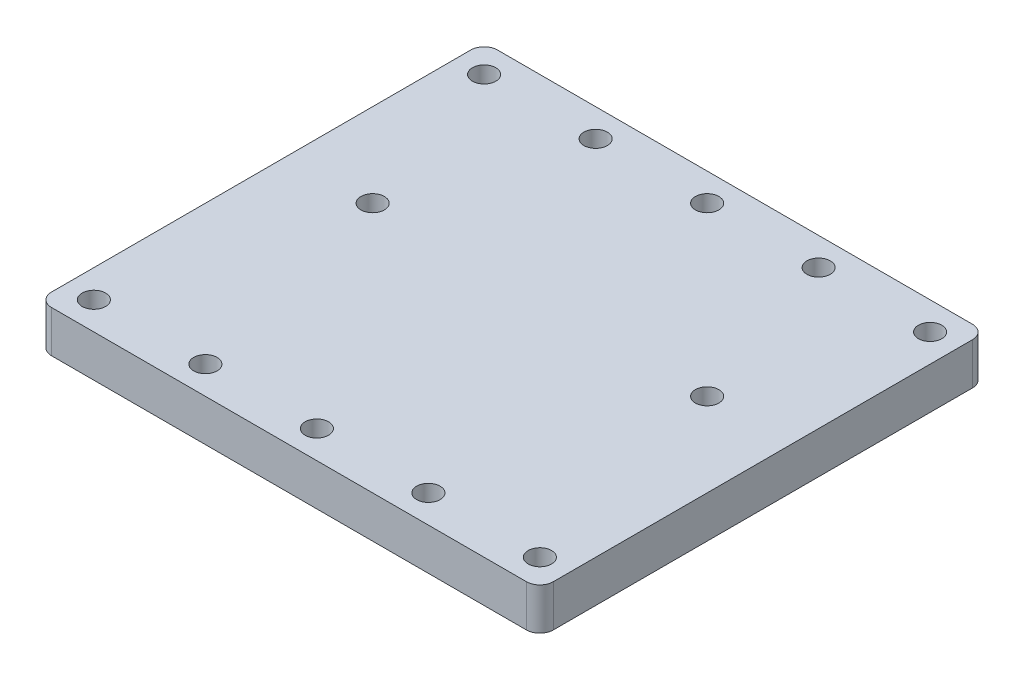
ISO-10303-21;
HEADER;
FILE_DESCRIPTION(('STEP AP214'),'2;1');
FILE_NAME('part.step','',(''),(''),'','','');
FILE_SCHEMA(('AUTOMOTIVE_DESIGN { 1 0 10303 214 1 1 1 1 }'));
ENDSEC;
DATA;
#1=APPLICATION_CONTEXT('core data for automotive mechanical design processes');
#2=APPLICATION_PROTOCOL_DEFINITION('international standard','automotive_design',2000,#1);
#3=PRODUCT_CONTEXT('',#1,'mechanical');
#4=PRODUCT('Part','Part','',(#3));
#5=PRODUCT_RELATED_PRODUCT_CATEGORY('part','',(#4));
#6=PRODUCT_DEFINITION_FORMATION('','',#4);
#7=PRODUCT_DEFINITION_CONTEXT('part definition',#1,'design');
#8=PRODUCT_DEFINITION('design','',#6,#7);
#9=PRODUCT_DEFINITION_SHAPE('','',#8);
#10=(LENGTH_UNIT() NAMED_UNIT(*) SI_UNIT(.MILLI.,.METRE.));
#11=(NAMED_UNIT(*) PLANE_ANGLE_UNIT() SI_UNIT($,.RADIAN.));
#12=(NAMED_UNIT(*) SI_UNIT($,.STERADIAN.) SOLID_ANGLE_UNIT());
#13=UNCERTAINTY_MEASURE_WITH_UNIT(LENGTH_MEASURE(1.E-05),#10,'distance_accuracy_value','');
#14=(GEOMETRIC_REPRESENTATION_CONTEXT(3) GLOBAL_UNCERTAINTY_ASSIGNED_CONTEXT((#13)) GLOBAL_UNIT_ASSIGNED_CONTEXT((#10,
#11,#12)) REPRESENTATION_CONTEXT('',''));
#15=CARTESIAN_POINT('',(0.,0.,0.));
#16=DIRECTION('',(0.,0.,1.));
#17=DIRECTION('',(1.,0.,0.));
#18=AXIS2_PLACEMENT_3D('',#15,#16,#17);
#19=CARTESIAN_POINT('',(-57.15,9.525,-50.8));
#20=DIRECTION('',(1.,0.,0.));
#21=DIRECTION('',(0.,0.,-1.));
#22=AXIS2_PLACEMENT_3D('',#19,#20,#21);
#23=PLANE('',#22);
#24=DIRECTION('',(0.,0.,1.));
#25=VECTOR('',#24,1.);
#26=CARTESIAN_POINT('',(-57.15,9.525,-50.8));
#27=LINE('',#26,#25);
#28=CARTESIAN_POINT('',(-57.15,9.525,-47.752));
#29=VERTEX_POINT('',#28);
#30=CARTESIAN_POINT('',(-57.15,9.525,47.752));
#31=VERTEX_POINT('',#30);
#32=EDGE_CURVE('E126',#29,#31,#27,.T.);
#33=ORIENTED_EDGE('',*,*,#32,.F.);
#34=DIRECTION('',(0.,-1.,0.));
#35=VECTOR('',#34,1.);
#36=CARTESIAN_POINT('',(-57.15,9.525,-47.752));
#37=LINE('',#36,#35);
#38=CARTESIAN_POINT('',(-57.15,0.,-47.752));
#39=VERTEX_POINT('',#38);
#40=EDGE_CURVE('E110',#29,#39,#37,.T.);
#41=ORIENTED_EDGE('',*,*,#40,.T.);
#42=DIRECTION('',(0.,0.,1.));
#43=VECTOR('',#42,1.);
#44=CARTESIAN_POINT('',(-57.15,0.,-50.8));
#45=LINE('',#44,#43);
#46=CARTESIAN_POINT('',(-57.15,0.,47.752));
#47=VERTEX_POINT('',#46);
#48=EDGE_CURVE('E123',#39,#47,#45,.T.);
#49=ORIENTED_EDGE('',*,*,#48,.T.);
#50=DIRECTION('',(0.,-1.,0.));
#51=VECTOR('',#50,1.);
#52=CARTESIAN_POINT('',(-57.15,9.525,47.752));
#53=LINE('',#52,#51);
#54=EDGE_CURVE('E129',#47,#31,#53,.F.);
#55=ORIENTED_EDGE('',*,*,#54,.T.);
#56=EDGE_LOOP('',(#33,#41,#49,#55));
#57=FACE_BOUND('',#56,.T.);
#58=ADVANCED_FACE('F39',(#57),#23,.F.);
#59=CARTESIAN_POINT('',(57.15,9.525,50.8));
#60=DIRECTION('',(0.,0.,-1.));
#61=DIRECTION('',(-1.,0.,0.));
#62=AXIS2_PLACEMENT_3D('',#59,#60,#61);
#63=PLANE('',#62);
#64=DIRECTION('',(1.,0.,0.));
#65=VECTOR('',#64,1.);
#66=CARTESIAN_POINT('',(57.15,0.,50.8));
#67=LINE('',#66,#65);
#68=CARTESIAN_POINT('',(-54.102,0.,50.8));
#69=VERTEX_POINT('',#68);
#70=CARTESIAN_POINT('',(54.102,0.,50.8));
#71=VERTEX_POINT('',#70);
#72=EDGE_CURVE('E134',#69,#71,#67,.T.);
#73=ORIENTED_EDGE('',*,*,#72,.T.);
#74=DIRECTION('',(0.,-1.,0.));
#75=VECTOR('',#74,1.);
#76=CARTESIAN_POINT('',(54.102,9.525,50.8));
#77=LINE('',#76,#75);
#78=CARTESIAN_POINT('',(54.102,9.525,50.8));
#79=VERTEX_POINT('',#78);
#80=EDGE_CURVE('E11',#71,#79,#77,.F.);
#81=ORIENTED_EDGE('',*,*,#80,.T.);
#82=DIRECTION('',(1.,0.,0.));
#83=VECTOR('',#82,1.);
#84=CARTESIAN_POINT('',(57.15,9.525,50.8));
#85=LINE('',#84,#83);
#86=CARTESIAN_POINT('',(-54.102,9.525,50.8));
#87=VERTEX_POINT('',#86);
#88=EDGE_CURVE('E191',#87,#79,#85,.T.);
#89=ORIENTED_EDGE('',*,*,#88,.F.);
#90=DIRECTION('',(0.,-1.,0.));
#91=VECTOR('',#90,1.);
#92=CARTESIAN_POINT('',(-54.102,9.525,50.8));
#93=LINE('',#92,#91);
#94=EDGE_CURVE('E48',#87,#69,#93,.T.);
#95=ORIENTED_EDGE('',*,*,#94,.T.);
#96=EDGE_LOOP('',(#73,#81,#89,#95));
#97=FACE_BOUND('',#96,.T.);
#98=ADVANCED_FACE('F189',(#97),#63,.F.);
#99=CARTESIAN_POINT('',(57.15,9.525,-50.8));
#100=DIRECTION('',(-1.,0.,0.));
#101=DIRECTION('',(0.,0.,1.));
#102=AXIS2_PLACEMENT_3D('',#99,#100,#101);
#103=PLANE('',#102);
#104=DIRECTION('',(0.,0.,-1.));
#105=VECTOR('',#104,1.);
#106=CARTESIAN_POINT('',(57.15,0.,-50.8));
#107=LINE('',#106,#105);
#108=CARTESIAN_POINT('',(57.15,0.,47.752));
#109=VERTEX_POINT('',#108);
#110=CARTESIAN_POINT('',(57.15,0.,-47.752));
#111=VERTEX_POINT('',#110);
#112=EDGE_CURVE('E140',#109,#111,#107,.T.);
#113=ORIENTED_EDGE('',*,*,#112,.T.);
#114=DIRECTION('',(0.,-1.,0.));
#115=VECTOR('',#114,1.);
#116=CARTESIAN_POINT('',(57.15,9.525,-47.752));
#117=LINE('',#116,#115);
#118=CARTESIAN_POINT('',(57.15,9.525,-47.752));
#119=VERTEX_POINT('',#118);
#120=EDGE_CURVE('E55',#111,#119,#117,.F.);
#121=ORIENTED_EDGE('',*,*,#120,.T.);
#122=DIRECTION('',(0.,0.,-1.));
#123=VECTOR('',#122,1.);
#124=CARTESIAN_POINT('',(57.15,9.525,-50.8));
#125=LINE('',#124,#123);
#126=CARTESIAN_POINT('',(57.15,9.525,47.752));
#127=VERTEX_POINT('',#126);
#128=EDGE_CURVE('E199',#127,#119,#125,.T.);
#129=ORIENTED_EDGE('',*,*,#128,.F.);
#130=DIRECTION('',(0.,-1.,0.));
#131=VECTOR('',#130,1.);
#132=CARTESIAN_POINT('',(57.15,9.525,47.752));
#133=LINE('',#132,#131);
#134=EDGE_CURVE('E179',#127,#109,#133,.T.);
#135=ORIENTED_EDGE('',*,*,#134,.T.);
#136=EDGE_LOOP('',(#113,#121,#129,#135));
#137=FACE_BOUND('',#136,.T.);
#138=ADVANCED_FACE('F198',(#137),#103,.F.);
#139=CARTESIAN_POINT('',(57.15,9.525,-50.8));
#140=DIRECTION('',(0.,0.,1.));
#141=DIRECTION('',(1.,0.,0.));
#142=AXIS2_PLACEMENT_3D('',#139,#140,#141);
#143=PLANE('',#142);
#144=DIRECTION('',(-1.,0.,0.));
#145=VECTOR('',#144,1.);
#146=CARTESIAN_POINT('',(57.15,0.,-50.8));
#147=LINE('',#146,#145);
#148=CARTESIAN_POINT('',(54.102,0.,-50.8));
#149=VERTEX_POINT('',#148);
#150=CARTESIAN_POINT('',(-54.102,0.,-50.8));
#151=VERTEX_POINT('',#150);
#152=EDGE_CURVE('E151',#149,#151,#147,.T.);
#153=ORIENTED_EDGE('',*,*,#152,.T.);
#154=DIRECTION('',(0.,-1.,0.));
#155=VECTOR('',#154,1.);
#156=CARTESIAN_POINT('',(-54.102,9.525,-50.8));
#157=LINE('',#156,#155);
#158=CARTESIAN_POINT('',(-54.102,9.525,-50.8));
#159=VERTEX_POINT('',#158);
#160=EDGE_CURVE('E111',#151,#159,#157,.F.);
#161=ORIENTED_EDGE('',*,*,#160,.T.);
#162=DIRECTION('',(-1.,0.,0.));
#163=VECTOR('',#162,1.);
#164=CARTESIAN_POINT('',(57.15,9.525,-50.8));
#165=LINE('',#164,#163);
#166=CARTESIAN_POINT('',(54.102,9.525,-50.8));
#167=VERTEX_POINT('',#166);
#168=EDGE_CURVE('E146',#167,#159,#165,.T.);
#169=ORIENTED_EDGE('',*,*,#168,.F.);
#170=DIRECTION('',(0.,-1.,0.));
#171=VECTOR('',#170,1.);
#172=CARTESIAN_POINT('',(54.102,9.525,-50.8));
#173=LINE('',#172,#171);
#174=EDGE_CURVE('E117',#167,#149,#173,.T.);
#175=ORIENTED_EDGE('',*,*,#174,.T.);
#176=EDGE_LOOP('',(#153,#161,#169,#175));
#177=FACE_BOUND('',#176,.T.);
#178=ADVANCED_FACE('F307',(#177),#143,.F.);
#179=CARTESIAN_POINT('',(0.,9.525,0.));
#180=DIRECTION('',(0.,-1.,0.));
#181=DIRECTION('',(0.,0.,-1.));
#182=AXIS2_PLACEMENT_3D('',#179,#180,#181);
#183=PLANE('',#182);
#184=CARTESIAN_POINT('',(-25.4,9.525,-44.4499999999995));
#185=DIRECTION('',(0.,1.,0.));
#186=DIRECTION('',(0.,0.,1.));
#187=AXIS2_PLACEMENT_3D('',#184,#185,#186);
#188=CIRCLE('',#187,2.667);
#189=CARTESIAN_POINT('',(-25.4,9.525,-41.7829999999995));
#190=VERTEX_POINT('',#189);
#191=EDGE_CURVE('E267',#190,#190,#188,.T.);
#192=ORIENTED_EDGE('',*,*,#191,.F.);
#193=EDGE_LOOP('',(#192));
#194=FACE_BOUND('',#193,.T.);
#195=CARTESIAN_POINT('',(0.,9.525,-44.4499999999996));
#196=DIRECTION('',(0.,1.,0.));
#197=DIRECTION('',(0.,0.,1.));
#198=AXIS2_PLACEMENT_3D('',#195,#196,#197);
#199=CIRCLE('',#198,2.667);
#200=CARTESIAN_POINT('',(0.,9.525,-41.7829999999996));
#201=VERTEX_POINT('',#200);
#202=EDGE_CURVE('E259',#201,#201,#199,.T.);
#203=ORIENTED_EDGE('',*,*,#202,.F.);
#204=EDGE_LOOP('',(#203));
#205=FACE_BOUND('',#204,.T.);
#206=CARTESIAN_POINT('',(25.4,9.525,-44.4499999999998));
#207=DIRECTION('',(0.,1.,0.));
#208=DIRECTION('',(0.,0.,1.));
#209=AXIS2_PLACEMENT_3D('',#206,#207,#208);
#210=CIRCLE('',#209,2.667);
#211=CARTESIAN_POINT('',(25.4,9.525,-41.7829999999998));
#212=VERTEX_POINT('',#211);
#213=EDGE_CURVE('E251',#212,#212,#210,.T.);
#214=ORIENTED_EDGE('',*,*,#213,.F.);
#215=EDGE_LOOP('',(#214));
#216=FACE_BOUND('',#215,.T.);
#217=CARTESIAN_POINT('',(50.8,9.525,-44.45));
#218=DIRECTION('',(0.,1.,0.));
#219=DIRECTION('',(0.,0.,1.));
#220=AXIS2_PLACEMENT_3D('',#217,#218,#219);
#221=CIRCLE('',#220,2.667);
#222=CARTESIAN_POINT('',(50.8,9.525,-41.783));
#223=VERTEX_POINT('',#222);
#224=EDGE_CURVE('E243',#223,#223,#221,.T.);
#225=ORIENTED_EDGE('',*,*,#224,.F.);
#226=EDGE_LOOP('',(#225));
#227=FACE_BOUND('',#226,.T.);
#228=CARTESIAN_POINT('',(38.1000000000004,9.525,-6.3499999999999));
#229=DIRECTION('',(0.,1.,0.));
#230=DIRECTION('',(0.,0.,1.));
#231=AXIS2_PLACEMENT_3D('',#228,#229,#230);
#232=CIRCLE('',#231,2.667);
#233=CARTESIAN_POINT('',(38.1000000000004,9.525,-3.68299999999989));
#234=VERTEX_POINT('',#233);
#235=EDGE_CURVE('E235',#234,#234,#232,.T.);
#236=ORIENTED_EDGE('',*,*,#235,.F.);
#237=EDGE_LOOP('',(#236));
#238=FACE_BOUND('',#237,.T.);
#239=CARTESIAN_POINT('',(-38.0999999999996,9.525,-6.34999999999936));
#240=DIRECTION('',(0.,1.,0.));
#241=DIRECTION('',(0.,0.,1.));
#242=AXIS2_PLACEMENT_3D('',#239,#240,#241);
#243=CIRCLE('',#242,2.667);
#244=CARTESIAN_POINT('',(-38.0999999999996,9.525,-3.68299999999936));
#245=VERTEX_POINT('',#244);
#246=EDGE_CURVE('E227',#245,#245,#243,.T.);
#247=ORIENTED_EDGE('',*,*,#246,.F.);
#248=EDGE_LOOP('',(#247));
#249=FACE_BOUND('',#248,.T.);
#250=CARTESIAN_POINT('',(-50.7999999999991,9.525,44.4500000000007));
#251=DIRECTION('',(0.,1.,0.));
#252=DIRECTION('',(0.,0.,1.));
#253=AXIS2_PLACEMENT_3D('',#250,#251,#252);
#254=CIRCLE('',#253,2.667);
#255=CARTESIAN_POINT('',(-50.7999999999991,9.525,47.1170000000007));
#256=VERTEX_POINT('',#255);
#257=EDGE_CURVE('E217',#256,#256,#254,.T.);
#258=ORIENTED_EDGE('',*,*,#257,.F.);
#259=EDGE_LOOP('',(#258));
#260=FACE_BOUND('',#259,.T.);
#261=CARTESIAN_POINT('',(-25.3999999999991,9.525,44.4500000000005));
#262=DIRECTION('',(0.,1.,0.));
#263=DIRECTION('',(0.,0.,1.));
#264=AXIS2_PLACEMENT_3D('',#261,#262,#263);
#265=CIRCLE('',#264,2.667);
#266=CARTESIAN_POINT('',(-25.3999999999991,9.525,47.1170000000005));
#267=VERTEX_POINT('',#266);
#268=EDGE_CURVE('E218',#267,#267,#265,.T.);
#269=ORIENTED_EDGE('',*,*,#268,.F.);
#270=EDGE_LOOP('',(#269));
#271=FACE_BOUND('',#270,.T.);
#272=CARTESIAN_POINT('',(9.08995101411847E-13,9.525,44.4500000000004));
#273=DIRECTION('',(0.,1.,0.));
#274=DIRECTION('',(0.,0.,1.));
#275=AXIS2_PLACEMENT_3D('',#272,#273,#274);
#276=CIRCLE('',#275,2.667);
#277=CARTESIAN_POINT('',(9.08995101411847E-13,9.525,47.1170000000004));
#278=VERTEX_POINT('',#277);
#279=EDGE_CURVE('E290',#278,#278,#276,.T.);
#280=ORIENTED_EDGE('',*,*,#279,.F.);
#281=EDGE_LOOP('',(#280));
#282=FACE_BOUND('',#281,.T.);
#283=CARTESIAN_POINT('',(25.4000000000009,9.525,44.4500000000002));
#284=DIRECTION('',(0.,1.,0.));
#285=DIRECTION('',(0.,0.,1.));
#286=AXIS2_PLACEMENT_3D('',#283,#284,#285);
#287=CIRCLE('',#286,2.667);
#288=CARTESIAN_POINT('',(25.4000000000009,9.525,47.1170000000002));
#289=VERTEX_POINT('',#288);
#290=EDGE_CURVE('E281',#289,#289,#287,.T.);
#291=ORIENTED_EDGE('',*,*,#290,.F.);
#292=EDGE_LOOP('',(#291));
#293=FACE_BOUND('',#292,.T.);
#294=CARTESIAN_POINT('',(50.8000000000009,9.525,44.45));
#295=DIRECTION('',(0.,1.,0.));
#296=DIRECTION('',(0.,0.,1.));
#297=AXIS2_PLACEMENT_3D('',#294,#295,#296);
#298=CIRCLE('',#297,2.667);
#299=CARTESIAN_POINT('',(50.8000000000009,9.525,47.117));
#300=VERTEX_POINT('',#299);
#301=EDGE_CURVE('E282',#300,#300,#298,.T.);
#302=ORIENTED_EDGE('',*,*,#301,.F.);
#303=EDGE_LOOP('',(#302));
#304=FACE_BOUND('',#303,.T.);
#305=CARTESIAN_POINT('',(-50.8,9.525,-44.4499999999993));
#306=DIRECTION('',(0.,1.,0.));
#307=DIRECTION('',(0.,0.,1.));
#308=AXIS2_PLACEMENT_3D('',#305,#306,#307);
#309=CIRCLE('',#308,2.667);
#310=CARTESIAN_POINT('',(-50.8,9.525,-41.7829999999993));
#311=VERTEX_POINT('',#310);
#312=EDGE_CURVE('E143',#311,#311,#309,.T.);
#313=ORIENTED_EDGE('',*,*,#312,.F.);
#314=EDGE_LOOP('',(#313));
#315=FACE_BOUND('',#314,.T.);
#316=ORIENTED_EDGE('',*,*,#168,.T.);
#317=CARTESIAN_POINT('',(-54.102,9.525,-47.752));
#318=DIRECTION('',(0.,-1.,0.));
#319=DIRECTION('',(0.,0.,-1.));
#320=AXIS2_PLACEMENT_3D('',#317,#318,#319);
#321=CIRCLE('',#320,3.048);
#322=EDGE_CURVE('E176',#159,#29,#321,.F.);
#323=ORIENTED_EDGE('',*,*,#322,.T.);
#324=ORIENTED_EDGE('',*,*,#32,.T.);
#325=CARTESIAN_POINT('',(-54.102,9.525,47.752));
#326=DIRECTION('',(0.,-1.,0.));
#327=DIRECTION('',(0.,0.,-1.));
#328=AXIS2_PLACEMENT_3D('',#325,#326,#327);
#329=CIRCLE('',#328,3.048);
#330=EDGE_CURVE('E168',#31,#87,#329,.F.);
#331=ORIENTED_EDGE('',*,*,#330,.T.);
#332=ORIENTED_EDGE('',*,*,#88,.T.);
#333=CARTESIAN_POINT('',(54.102,9.525,47.752));
#334=DIRECTION('',(0.,-1.,0.));
#335=DIRECTION('',(0.,0.,-1.));
#336=AXIS2_PLACEMENT_3D('',#333,#334,#335);
#337=CIRCLE('',#336,3.048);
#338=EDGE_CURVE('E62',#79,#127,#337,.F.);
#339=ORIENTED_EDGE('',*,*,#338,.T.);
#340=ORIENTED_EDGE('',*,*,#128,.T.);
#341=CARTESIAN_POINT('',(54.102,9.525,-47.752));
#342=DIRECTION('',(0.,-1.,0.));
#343=DIRECTION('',(0.,0.,-1.));
#344=AXIS2_PLACEMENT_3D('',#341,#342,#343);
#345=CIRCLE('',#344,3.048);
#346=EDGE_CURVE('E173',#119,#167,#345,.F.);
#347=ORIENTED_EDGE('',*,*,#346,.T.);
#348=EDGE_LOOP('',(#316,#323,#324,#331,#332,#339,#340,#347));
#349=FACE_BOUND('',#348,.T.);
#350=ADVANCED_FACE('F304',(#194,#205,#216,#227,#238,#249,#260,#271,#282,#293,#304,#315,#349),
#183,.F.);
#351=CARTESIAN_POINT('',(0.,0.,0.));
#352=DIRECTION('',(0.,-1.,0.));
#353=DIRECTION('',(0.,0.,-1.));
#354=AXIS2_PLACEMENT_3D('',#351,#352,#353);
#355=PLANE('',#354);
#356=CARTESIAN_POINT('',(-25.4,0.,-44.4499999999995));
#357=DIRECTION('',(0.,-1.,0.));
#358=DIRECTION('',(0.,0.,-1.));
#359=AXIS2_PLACEMENT_3D('',#356,#357,#358);
#360=CIRCLE('',#359,2.667);
#361=CARTESIAN_POINT('',(-25.4,0.,-47.1169999999995));
#362=VERTEX_POINT('',#361);
#363=EDGE_CURVE('E212',#362,#362,#360,.F.);
#364=ORIENTED_EDGE('',*,*,#363,.T.);
#365=EDGE_LOOP('',(#364));
#366=FACE_BOUND('',#365,.T.);
#367=CARTESIAN_POINT('',(0.,0.,-44.4499999999996));
#368=DIRECTION('',(0.,-1.,0.));
#369=DIRECTION('',(0.,0.,-1.));
#370=AXIS2_PLACEMENT_3D('',#367,#368,#369);
#371=CIRCLE('',#370,2.667);
#372=CARTESIAN_POINT('',(0.,0.,-47.1169999999996));
#373=VERTEX_POINT('',#372);
#374=EDGE_CURVE('E263',#373,#373,#371,.F.);
#375=ORIENTED_EDGE('',*,*,#374,.T.);
#376=EDGE_LOOP('',(#375));
#377=FACE_BOUND('',#376,.T.);
#378=CARTESIAN_POINT('',(25.4,0.,-44.4499999999998));
#379=DIRECTION('',(0.,-1.,0.));
#380=DIRECTION('',(0.,0.,-1.));
#381=AXIS2_PLACEMENT_3D('',#378,#379,#380);
#382=CIRCLE('',#381,2.667);
#383=CARTESIAN_POINT('',(25.4,0.,-47.1169999999998));
#384=VERTEX_POINT('',#383);
#385=EDGE_CURVE('E255',#384,#384,#382,.F.);
#386=ORIENTED_EDGE('',*,*,#385,.T.);
#387=EDGE_LOOP('',(#386));
#388=FACE_BOUND('',#387,.T.);
#389=CARTESIAN_POINT('',(50.8,0.,-44.45));
#390=DIRECTION('',(0.,-1.,0.));
#391=DIRECTION('',(0.,0.,-1.));
#392=AXIS2_PLACEMENT_3D('',#389,#390,#391);
#393=CIRCLE('',#392,2.667);
#394=CARTESIAN_POINT('',(50.8,0.,-47.117));
#395=VERTEX_POINT('',#394);
#396=EDGE_CURVE('E247',#395,#395,#393,.F.);
#397=ORIENTED_EDGE('',*,*,#396,.T.);
#398=EDGE_LOOP('',(#397));
#399=FACE_BOUND('',#398,.T.);
#400=CARTESIAN_POINT('',(38.1000000000004,0.,-6.3499999999999));
#401=DIRECTION('',(0.,-1.,0.));
#402=DIRECTION('',(0.,0.,-1.));
#403=AXIS2_PLACEMENT_3D('',#400,#401,#402);
#404=CIRCLE('',#403,2.667);
#405=CARTESIAN_POINT('',(38.1000000000004,0.,-9.0169999999999));
#406=VERTEX_POINT('',#405);
#407=EDGE_CURVE('E239',#406,#406,#404,.F.);
#408=ORIENTED_EDGE('',*,*,#407,.T.);
#409=EDGE_LOOP('',(#408));
#410=FACE_BOUND('',#409,.T.);
#411=CARTESIAN_POINT('',(-38.0999999999996,0.,-6.34999999999936));
#412=DIRECTION('',(0.,-1.,0.));
#413=DIRECTION('',(0.,0.,-1.));
#414=AXIS2_PLACEMENT_3D('',#411,#412,#413);
#415=CIRCLE('',#414,2.667);
#416=CARTESIAN_POINT('',(-38.0999999999996,0.,-9.01699999999937));
#417=VERTEX_POINT('',#416);
#418=EDGE_CURVE('E231',#417,#417,#415,.F.);
#419=ORIENTED_EDGE('',*,*,#418,.T.);
#420=EDGE_LOOP('',(#419));
#421=FACE_BOUND('',#420,.T.);
#422=CARTESIAN_POINT('',(-50.7999999999991,0.,44.4500000000007));
#423=DIRECTION('',(0.,-1.,0.));
#424=DIRECTION('',(0.,0.,-1.));
#425=AXIS2_PLACEMENT_3D('',#422,#423,#424);
#426=CIRCLE('',#425,2.667);
#427=CARTESIAN_POINT('',(-50.7999999999991,0.,41.7830000000007));
#428=VERTEX_POINT('',#427);
#429=EDGE_CURVE('E223',#428,#428,#426,.F.);
#430=ORIENTED_EDGE('',*,*,#429,.T.);
#431=EDGE_LOOP('',(#430));
#432=FACE_BOUND('',#431,.T.);
#433=CARTESIAN_POINT('',(-25.3999999999991,0.,44.4500000000005));
#434=DIRECTION('',(0.,-1.,0.));
#435=DIRECTION('',(0.,0.,-1.));
#436=AXIS2_PLACEMENT_3D('',#433,#434,#435);
#437=CIRCLE('',#436,2.667);
#438=CARTESIAN_POINT('',(-25.3999999999991,0.,41.7830000000005));
#439=VERTEX_POINT('',#438);
#440=EDGE_CURVE('E213',#439,#439,#437,.F.);
#441=ORIENTED_EDGE('',*,*,#440,.T.);
#442=EDGE_LOOP('',(#441));
#443=FACE_BOUND('',#442,.T.);
#444=CARTESIAN_POINT('',(9.08995101411847E-13,0.,44.4500000000004));
#445=DIRECTION('',(0.,-1.,0.));
#446=DIRECTION('',(0.,0.,-1.));
#447=AXIS2_PLACEMENT_3D('',#444,#445,#446);
#448=CIRCLE('',#447,2.667);
#449=CARTESIAN_POINT('',(9.08995101411847E-13,0.,41.7830000000004));
#450=VERTEX_POINT('',#449);
#451=EDGE_CURVE('E222',#450,#450,#448,.F.);
#452=ORIENTED_EDGE('',*,*,#451,.T.);
#453=EDGE_LOOP('',(#452));
#454=FACE_BOUND('',#453,.T.);
#455=CARTESIAN_POINT('',(25.4000000000009,0.,44.4500000000002));
#456=DIRECTION('',(0.,-1.,0.));
#457=DIRECTION('',(0.,0.,-1.));
#458=AXIS2_PLACEMENT_3D('',#455,#456,#457);
#459=CIRCLE('',#458,2.667);
#460=CARTESIAN_POINT('',(25.4000000000009,0.,41.7830000000002));
#461=VERTEX_POINT('',#460);
#462=EDGE_CURVE('E286',#461,#461,#459,.F.);
#463=ORIENTED_EDGE('',*,*,#462,.T.);
#464=EDGE_LOOP('',(#463));
#465=FACE_BOUND('',#464,.T.);
#466=CARTESIAN_POINT('',(50.8000000000009,0.,44.45));
#467=DIRECTION('',(0.,-1.,0.));
#468=DIRECTION('',(0.,0.,-1.));
#469=AXIS2_PLACEMENT_3D('',#466,#467,#468);
#470=CIRCLE('',#469,2.667);
#471=CARTESIAN_POINT('',(50.8000000000009,0.,41.783));
#472=VERTEX_POINT('',#471);
#473=EDGE_CURVE('E277',#472,#472,#470,.F.);
#474=ORIENTED_EDGE('',*,*,#473,.T.);
#475=EDGE_LOOP('',(#474));
#476=FACE_BOUND('',#475,.T.);
#477=CARTESIAN_POINT('',(-50.8,0.,-44.4499999999993));
#478=DIRECTION('',(0.,-1.,0.));
#479=DIRECTION('',(0.,0.,-1.));
#480=AXIS2_PLACEMENT_3D('',#477,#478,#479);
#481=CIRCLE('',#480,2.667);
#482=CARTESIAN_POINT('',(-50.8,0.,-47.1169999999993));
#483=VERTEX_POINT('',#482);
#484=EDGE_CURVE('E135',#483,#483,#481,.F.);
#485=ORIENTED_EDGE('',*,*,#484,.T.);
#486=EDGE_LOOP('',(#485));
#487=FACE_BOUND('',#486,.T.);
#488=ORIENTED_EDGE('',*,*,#48,.F.);
#489=CARTESIAN_POINT('',(-54.102,0.,-47.752));
#490=DIRECTION('',(0.,-1.,0.));
#491=DIRECTION('',(0.,0.,-1.));
#492=AXIS2_PLACEMENT_3D('',#489,#490,#491);
#493=CIRCLE('',#492,3.048);
#494=EDGE_CURVE('E106',#39,#151,#493,.T.);
#495=ORIENTED_EDGE('',*,*,#494,.T.);
#496=ORIENTED_EDGE('',*,*,#152,.F.);
#497=CARTESIAN_POINT('',(54.102,0.,-47.752));
#498=DIRECTION('',(0.,-1.,0.));
#499=DIRECTION('',(0.,0.,-1.));
#500=AXIS2_PLACEMENT_3D('',#497,#498,#499);
#501=CIRCLE('',#500,3.048);
#502=EDGE_CURVE('E118',#149,#111,#501,.T.);
#503=ORIENTED_EDGE('',*,*,#502,.T.);
#504=ORIENTED_EDGE('',*,*,#112,.F.);
#505=CARTESIAN_POINT('',(54.102,0.,47.752));
#506=DIRECTION('',(0.,-1.,0.));
#507=DIRECTION('',(0.,0.,-1.));
#508=AXIS2_PLACEMENT_3D('',#505,#506,#507);
#509=CIRCLE('',#508,3.048);
#510=EDGE_CURVE('E158',#109,#71,#509,.T.);
#511=ORIENTED_EDGE('',*,*,#510,.T.);
#512=ORIENTED_EDGE('',*,*,#72,.F.);
#513=CARTESIAN_POINT('',(-54.102,0.,47.752));
#514=DIRECTION('',(0.,-1.,0.));
#515=DIRECTION('',(0.,0.,-1.));
#516=AXIS2_PLACEMENT_3D('',#513,#514,#515);
#517=CIRCLE('',#516,3.048);
#518=EDGE_CURVE('E128',#69,#47,#517,.T.);
#519=ORIENTED_EDGE('',*,*,#518,.T.);
#520=EDGE_LOOP('',(#488,#495,#496,#503,#504,#511,#512,#519));
#521=FACE_BOUND('',#520,.T.);
#522=ADVANCED_FACE('F131',(#366,#377,#388,#399,#410,#421,#432,#443,#454,#465,#476,#487,#521),
#355,.T.);
#523=CARTESIAN_POINT('',(-54.102,9.525,-47.752));
#524=DIRECTION('',(0.,-1.,0.));
#525=DIRECTION('',(0.,0.,-1.));
#526=AXIS2_PLACEMENT_3D('',#523,#524,#525);
#527=CYLINDRICAL_SURFACE('',#526,3.048);
#528=ORIENTED_EDGE('',*,*,#322,.F.);
#529=ORIENTED_EDGE('',*,*,#160,.F.);
#530=ORIENTED_EDGE('',*,*,#494,.F.);
#531=ORIENTED_EDGE('',*,*,#40,.F.);
#532=EDGE_LOOP('',(#528,#529,#530,#531));
#533=FACE_BOUND('',#532,.T.);
#534=ADVANCED_FACE('F109',(#533),#527,.T.);
#535=CARTESIAN_POINT('',(54.102,9.525,-47.752));
#536=DIRECTION('',(0.,-1.,0.));
#537=DIRECTION('',(0.,0.,-1.));
#538=AXIS2_PLACEMENT_3D('',#535,#536,#537);
#539=CYLINDRICAL_SURFACE('',#538,3.048);
#540=ORIENTED_EDGE('',*,*,#346,.F.);
#541=ORIENTED_EDGE('',*,*,#120,.F.);
#542=ORIENTED_EDGE('',*,*,#502,.F.);
#543=ORIENTED_EDGE('',*,*,#174,.F.);
#544=EDGE_LOOP('',(#540,#541,#542,#543));
#545=FACE_BOUND('',#544,.T.);
#546=ADVANCED_FACE('F319',(#545),#539,.T.);
#547=CARTESIAN_POINT('',(54.102,9.525,47.752));
#548=DIRECTION('',(0.,-1.,0.));
#549=DIRECTION('',(0.,0.,-1.));
#550=AXIS2_PLACEMENT_3D('',#547,#548,#549);
#551=CYLINDRICAL_SURFACE('',#550,3.048);
#552=ORIENTED_EDGE('',*,*,#338,.F.);
#553=ORIENTED_EDGE('',*,*,#80,.F.);
#554=ORIENTED_EDGE('',*,*,#510,.F.);
#555=ORIENTED_EDGE('',*,*,#134,.F.);
#556=EDGE_LOOP('',(#552,#553,#554,#555));
#557=FACE_BOUND('',#556,.T.);
#558=ADVANCED_FACE('F197',(#557),#551,.T.);
#559=CARTESIAN_POINT('',(-54.102,9.525,47.752));
#560=DIRECTION('',(0.,-1.,0.));
#561=DIRECTION('',(0.,0.,-1.));
#562=AXIS2_PLACEMENT_3D('',#559,#560,#561);
#563=CYLINDRICAL_SURFACE('',#562,3.048);
#564=ORIENTED_EDGE('',*,*,#330,.F.);
#565=ORIENTED_EDGE('',*,*,#54,.F.);
#566=ORIENTED_EDGE('',*,*,#518,.F.);
#567=ORIENTED_EDGE('',*,*,#94,.F.);
#568=EDGE_LOOP('',(#564,#565,#566,#567));
#569=FACE_BOUND('',#568,.T.);
#570=ADVANCED_FACE('F41',(#569),#563,.T.);
#571=CARTESIAN_POINT('',(-50.8,-7.5434151416981,-44.4499999999993));
#572=DIRECTION('',(0.,1.,0.));
#573=DIRECTION('',(0.,0.,1.));
#574=AXIS2_PLACEMENT_3D('',#571,#572,#573);
#575=CYLINDRICAL_SURFACE('',#574,2.667);
#576=ORIENTED_EDGE('',*,*,#312,.T.);
#577=EDGE_LOOP('',(#576));
#578=FACE_BOUND('',#577,.T.);
#579=ORIENTED_EDGE('',*,*,#484,.F.);
#580=EDGE_LOOP('',(#579));
#581=FACE_BOUND('',#580,.T.);
#582=ADVANCED_FACE('F341',(#578,#581),#575,.F.);
#583=CARTESIAN_POINT('',(50.8000000000009,-7.5434151416981,44.45));
#584=DIRECTION('',(0.,1.,0.));
#585=DIRECTION('',(0.,0.,1.));
#586=AXIS2_PLACEMENT_3D('',#583,#584,#585);
#587=CYLINDRICAL_SURFACE('',#586,2.667);
#588=ORIENTED_EDGE('',*,*,#301,.T.);
#589=EDGE_LOOP('',(#588));
#590=FACE_BOUND('',#589,.T.);
#591=ORIENTED_EDGE('',*,*,#473,.F.);
#592=EDGE_LOOP('',(#591));
#593=FACE_BOUND('',#592,.T.);
#594=ADVANCED_FACE('F344',(#590,#593),#587,.F.);
#595=CARTESIAN_POINT('',(25.4000000000009,-7.5434151416981,44.4500000000002));
#596=DIRECTION('',(0.,1.,0.));
#597=DIRECTION('',(0.,0.,1.));
#598=AXIS2_PLACEMENT_3D('',#595,#596,#597);
#599=CYLINDRICAL_SURFACE('',#598,2.667);
#600=ORIENTED_EDGE('',*,*,#290,.T.);
#601=EDGE_LOOP('',(#600));
#602=FACE_BOUND('',#601,.T.);
#603=ORIENTED_EDGE('',*,*,#462,.F.);
#604=EDGE_LOOP('',(#603));
#605=FACE_BOUND('',#604,.T.);
#606=ADVANCED_FACE('F380',(#602,#605),#599,.F.);
#607=CARTESIAN_POINT('',(9.08995101411847E-13,-7.5434151416981,44.4500000000004));
#608=DIRECTION('',(0.,1.,0.));
#609=DIRECTION('',(0.,0.,1.));
#610=AXIS2_PLACEMENT_3D('',#607,#608,#609);
#611=CYLINDRICAL_SURFACE('',#610,2.667);
#612=ORIENTED_EDGE('',*,*,#279,.T.);
#613=EDGE_LOOP('',(#612));
#614=FACE_BOUND('',#613,.T.);
#615=ORIENTED_EDGE('',*,*,#451,.F.);
#616=EDGE_LOOP('',(#615));
#617=FACE_BOUND('',#616,.T.);
#618=ADVANCED_FACE('F301',(#614,#617),#611,.F.);
#619=CARTESIAN_POINT('',(-25.3999999999991,-7.5434151416981,44.4500000000005));
#620=DIRECTION('',(0.,1.,0.));
#621=DIRECTION('',(0.,0.,1.));
#622=AXIS2_PLACEMENT_3D('',#619,#620,#621);
#623=CYLINDRICAL_SURFACE('',#622,2.667);
#624=ORIENTED_EDGE('',*,*,#268,.T.);
#625=EDGE_LOOP('',(#624));
#626=FACE_BOUND('',#625,.T.);
#627=ORIENTED_EDGE('',*,*,#440,.F.);
#628=EDGE_LOOP('',(#627));
#629=FACE_BOUND('',#628,.T.);
#630=ADVANCED_FACE('F346',(#626,#629),#623,.F.);
#631=CARTESIAN_POINT('',(-50.7999999999991,-7.5434151416981,44.4500000000007));
#632=DIRECTION('',(0.,1.,0.));
#633=DIRECTION('',(0.,0.,1.));
#634=AXIS2_PLACEMENT_3D('',#631,#632,#633);
#635=CYLINDRICAL_SURFACE('',#634,2.667);
#636=ORIENTED_EDGE('',*,*,#257,.T.);
#637=EDGE_LOOP('',(#636));
#638=FACE_BOUND('',#637,.T.);
#639=ORIENTED_EDGE('',*,*,#429,.F.);
#640=EDGE_LOOP('',(#639));
#641=FACE_BOUND('',#640,.T.);
#642=ADVANCED_FACE('F349',(#638,#641),#635,.F.);
#643=CARTESIAN_POINT('',(-38.0999999999996,-7.5434151416981,-6.34999999999936));
#644=DIRECTION('',(0.,1.,0.));
#645=DIRECTION('',(0.,0.,1.));
#646=AXIS2_PLACEMENT_3D('',#643,#644,#645);
#647=CYLINDRICAL_SURFACE('',#646,2.667);
#648=ORIENTED_EDGE('',*,*,#246,.T.);
#649=EDGE_LOOP('',(#648));
#650=FACE_BOUND('',#649,.T.);
#651=ORIENTED_EDGE('',*,*,#418,.F.);
#652=EDGE_LOOP('',(#651));
#653=FACE_BOUND('',#652,.T.);
#654=ADVANCED_FACE('F353',(#650,#653),#647,.F.);
#655=CARTESIAN_POINT('',(38.1000000000004,-7.5434151416981,-6.3499999999999));
#656=DIRECTION('',(0.,1.,0.));
#657=DIRECTION('',(0.,0.,1.));
#658=AXIS2_PLACEMENT_3D('',#655,#656,#657);
#659=CYLINDRICAL_SURFACE('',#658,2.667);
#660=ORIENTED_EDGE('',*,*,#235,.T.);
#661=EDGE_LOOP('',(#660));
#662=FACE_BOUND('',#661,.T.);
#663=ORIENTED_EDGE('',*,*,#407,.F.);
#664=EDGE_LOOP('',(#663));
#665=FACE_BOUND('',#664,.T.);
#666=ADVANCED_FACE('F357',(#662,#665),#659,.F.);
#667=CARTESIAN_POINT('',(50.8,-7.5434151416981,-44.45));
#668=DIRECTION('',(0.,1.,0.));
#669=DIRECTION('',(0.,0.,1.));
#670=AXIS2_PLACEMENT_3D('',#667,#668,#669);
#671=CYLINDRICAL_SURFACE('',#670,2.667);
#672=ORIENTED_EDGE('',*,*,#224,.T.);
#673=EDGE_LOOP('',(#672));
#674=FACE_BOUND('',#673,.T.);
#675=ORIENTED_EDGE('',*,*,#396,.F.);
#676=EDGE_LOOP('',(#675));
#677=FACE_BOUND('',#676,.T.);
#678=ADVANCED_FACE('F361',(#674,#677),#671,.F.);
#679=CARTESIAN_POINT('',(25.4,-7.5434151416981,-44.4499999999998));
#680=DIRECTION('',(0.,1.,0.));
#681=DIRECTION('',(0.,0.,1.));
#682=AXIS2_PLACEMENT_3D('',#679,#680,#681);
#683=CYLINDRICAL_SURFACE('',#682,2.667);
#684=ORIENTED_EDGE('',*,*,#213,.T.);
#685=EDGE_LOOP('',(#684));
#686=FACE_BOUND('',#685,.T.);
#687=ORIENTED_EDGE('',*,*,#385,.F.);
#688=EDGE_LOOP('',(#687));
#689=FACE_BOUND('',#688,.T.);
#690=ADVANCED_FACE('F365',(#686,#689),#683,.F.);
#691=CARTESIAN_POINT('',(0.,-7.5434151416981,-44.4499999999996));
#692=DIRECTION('',(0.,1.,0.));
#693=DIRECTION('',(0.,0.,1.));
#694=AXIS2_PLACEMENT_3D('',#691,#692,#693);
#695=CYLINDRICAL_SURFACE('',#694,2.667);
#696=ORIENTED_EDGE('',*,*,#202,.T.);
#697=EDGE_LOOP('',(#696));
#698=FACE_BOUND('',#697,.T.);
#699=ORIENTED_EDGE('',*,*,#374,.F.);
#700=EDGE_LOOP('',(#699));
#701=FACE_BOUND('',#700,.T.);
#702=ADVANCED_FACE('F369',(#698,#701),#695,.F.);
#703=CARTESIAN_POINT('',(-25.4,-7.5434151416981,-44.4499999999995));
#704=DIRECTION('',(0.,1.,0.));
#705=DIRECTION('',(0.,0.,1.));
#706=AXIS2_PLACEMENT_3D('',#703,#704,#705);
#707=CYLINDRICAL_SURFACE('',#706,2.667);
#708=ORIENTED_EDGE('',*,*,#191,.T.);
#709=EDGE_LOOP('',(#708));
#710=FACE_BOUND('',#709,.T.);
#711=ORIENTED_EDGE('',*,*,#363,.F.);
#712=EDGE_LOOP('',(#711));
#713=FACE_BOUND('',#712,.T.);
#714=ADVANCED_FACE('F373',(#710,#713),#707,.F.);
#715=CLOSED_SHELL('',(#58,#98,#138,#178,#350,#522,#534,#546,#558,#570,#582,#594,#606,#618,#630,
#642,#654,#666,#678,#690,#702,#714));
#716=MANIFOLD_SOLID_BREP('B2',#715);
#717=ADVANCED_BREP_SHAPE_REPRESENTATION('',(#18,#716),#14);
#718=SHAPE_DEFINITION_REPRESENTATION(#9,#717);
ENDSEC;
END-ISO-10303-21;
